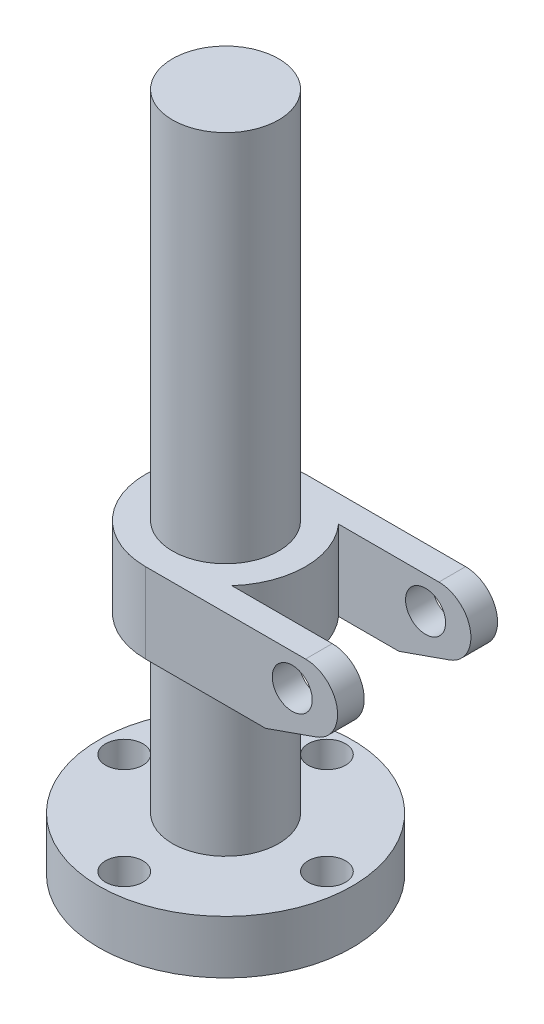
ISO-10303-21;
HEADER;
FILE_DESCRIPTION(('STEP AP214'),'2;1');
FILE_NAME('part.step','',(''),(''),'','','');
FILE_SCHEMA(('AUTOMOTIVE_DESIGN { 1 0 10303 214 1 1 1 1 }'));
ENDSEC;
DATA;
#1=APPLICATION_CONTEXT('core data for automotive mechanical design processes');
#2=APPLICATION_PROTOCOL_DEFINITION('international standard','automotive_design',2000,#1);
#3=PRODUCT_CONTEXT('',#1,'mechanical');
#4=PRODUCT('Part','Part','',(#3));
#5=PRODUCT_RELATED_PRODUCT_CATEGORY('part','',(#4));
#6=PRODUCT_DEFINITION_FORMATION('','',#4);
#7=PRODUCT_DEFINITION_CONTEXT('part definition',#1,'design');
#8=PRODUCT_DEFINITION('design','',#6,#7);
#9=PRODUCT_DEFINITION_SHAPE('','',#8);
#10=(LENGTH_UNIT() NAMED_UNIT(*) SI_UNIT(.MILLI.,.METRE.));
#11=(NAMED_UNIT(*) PLANE_ANGLE_UNIT() SI_UNIT($,.RADIAN.));
#12=(NAMED_UNIT(*) SI_UNIT($,.STERADIAN.) SOLID_ANGLE_UNIT());
#13=UNCERTAINTY_MEASURE_WITH_UNIT(LENGTH_MEASURE(1.E-05),#10,'distance_accuracy_value','');
#14=(GEOMETRIC_REPRESENTATION_CONTEXT(3) GLOBAL_UNCERTAINTY_ASSIGNED_CONTEXT((#13)) GLOBAL_UNIT_ASSIGNED_CONTEXT((#10,
#11,#12)) REPRESENTATION_CONTEXT('',''));
#15=CARTESIAN_POINT('',(0.,0.,0.));
#16=DIRECTION('',(0.,0.,1.));
#17=DIRECTION('',(1.,0.,0.));
#18=AXIS2_PLACEMENT_3D('',#15,#16,#17);
#19=CARTESIAN_POINT('',(0.,115.,0.));
#20=DIRECTION('',(0.,-1.,0.));
#21=DIRECTION('',(0.,0.,-1.));
#22=AXIS2_PLACEMENT_3D('',#19,#20,#21);
#23=PLANE('',#22);
#24=CARTESIAN_POINT('',(0.,115.,0.));
#25=DIRECTION('',(0.,1.,0.));
#26=DIRECTION('',(0.,0.,1.));
#27=AXIS2_PLACEMENT_3D('',#24,#25,#26);
#28=CIRCLE('',#27,19.9);
#29=CARTESIAN_POINT('',(0.,115.,19.9));
#30=VERTEX_POINT('',#29);
#31=EDGE_CURVE('E192',#30,#30,#28,.T.);
#32=ORIENTED_EDGE('',*,*,#31,.F.);
#33=EDGE_LOOP('',(#32));
#34=FACE_BOUND('',#33,.T.);
#35=DIRECTION('',(1.,0.,0.));
#36=VECTOR('',#35,1.);
#37=CARTESIAN_POINT('',(0.,115.,30.));
#38=LINE('',#37,#36);
#39=CARTESIAN_POINT('',(0.,115.,30.));
#40=VERTEX_POINT('',#39);
#41=CARTESIAN_POINT('',(60.,115.,30.));
#42=VERTEX_POINT('',#41);
#43=EDGE_CURVE('E133',#40,#42,#38,.T.);
#44=ORIENTED_EDGE('',*,*,#43,.T.);
#45=DIRECTION('',(0.,0.,-1.));
#46=VECTOR('',#45,1.);
#47=CARTESIAN_POINT('',(60.,115.,47.5));
#48=LINE('',#47,#46);
#49=CARTESIAN_POINT('',(60.,115.,20.));
#50=VERTEX_POINT('',#49);
#51=EDGE_CURVE('E214',#42,#50,#48,.T.);
#52=ORIENTED_EDGE('',*,*,#51,.T.);
#53=DIRECTION('',(1.,0.,0.));
#54=VECTOR('',#53,1.);
#55=CARTESIAN_POINT('',(0.,115.,20.));
#56=LINE('',#55,#54);
#57=CARTESIAN_POINT('',(22.3606797749979,115.,20.));
#58=VERTEX_POINT('',#57);
#59=EDGE_CURVE('E68',#58,#50,#56,.T.);
#60=ORIENTED_EDGE('',*,*,#59,.F.);
#61=CARTESIAN_POINT('',(0.,115.,0.));
#62=DIRECTION('',(0.,1.,0.));
#63=DIRECTION('',(0.,0.,1.));
#64=AXIS2_PLACEMENT_3D('',#61,#62,#63);
#65=CIRCLE('',#64,30.);
#66=CARTESIAN_POINT('',(22.3606797749979,115.,-20.));
#67=VERTEX_POINT('',#66);
#68=EDGE_CURVE('E268',#58,#67,#65,.T.);
#69=ORIENTED_EDGE('',*,*,#68,.T.);
#70=DIRECTION('',(1.,0.,0.));
#71=VECTOR('',#70,1.);
#72=CARTESIAN_POINT('',(0.,115.,-20.));
#73=LINE('',#72,#71);
#74=CARTESIAN_POINT('',(60.,115.,-20.));
#75=VERTEX_POINT('',#74);
#76=EDGE_CURVE('E272',#67,#75,#73,.T.);
#77=ORIENTED_EDGE('',*,*,#76,.T.);
#78=CARTESIAN_POINT('',(60.,115.,-30.));
#79=VERTEX_POINT('',#78);
#80=EDGE_CURVE('E223',#75,#79,#48,.T.);
#81=ORIENTED_EDGE('',*,*,#80,.T.);
#82=DIRECTION('',(-1.,0.,0.));
#83=VECTOR('',#82,1.);
#84=CARTESIAN_POINT('',(0.,115.,-30.));
#85=LINE('',#84,#83);
#86=CARTESIAN_POINT('',(0.,115.,-30.));
#87=VERTEX_POINT('',#86);
#88=EDGE_CURVE('E60',#79,#87,#85,.T.);
#89=ORIENTED_EDGE('',*,*,#88,.T.);
#90=CARTESIAN_POINT('',(0.,115.,0.));
#91=DIRECTION('',(0.,1.,0.));
#92=DIRECTION('',(0.,0.,1.));
#93=AXIS2_PLACEMENT_3D('',#90,#91,#92);
#94=CIRCLE('',#93,30.);
#95=EDGE_CURVE('E188',#87,#40,#94,.T.);
#96=ORIENTED_EDGE('',*,*,#95,.T.);
#97=EDGE_LOOP('',(#44,#52,#60,#69,#77,#81,#89,#96));
#98=FACE_BOUND('',#97,.T.);
#99=ADVANCED_FACE('F44',(#34,#98),#23,.F.);
#100=CARTESIAN_POINT('',(0.,85.,0.));
#101=DIRECTION('',(0.,1.,0.));
#102=DIRECTION('',(0.,0.,1.));
#103=AXIS2_PLACEMENT_3D('',#100,#101,#102);
#104=PLANE('',#103);
#105=CARTESIAN_POINT('',(0.,85.,0.));
#106=DIRECTION('',(0.,1.,0.));
#107=DIRECTION('',(0.,0.,1.));
#108=AXIS2_PLACEMENT_3D('',#105,#106,#107);
#109=CIRCLE('',#108,19.9);
#110=CARTESIAN_POINT('',(0.,85.,19.9));
#111=VERTEX_POINT('',#110);
#112=EDGE_CURVE('E181',#111,#111,#109,.T.);
#113=ORIENTED_EDGE('',*,*,#112,.T.);
#114=EDGE_LOOP('',(#113));
#115=FACE_BOUND('',#114,.T.);
#116=DIRECTION('',(-1.,0.,0.));
#117=VECTOR('',#116,1.);
#118=CARTESIAN_POINT('',(0.,85.,30.));
#119=LINE('',#118,#117);
#120=CARTESIAN_POINT('',(45.,85.,30.));
#121=VERTEX_POINT('',#120);
#122=CARTESIAN_POINT('',(0.,85.,30.));
#123=VERTEX_POINT('',#122);
#124=EDGE_CURVE('E121',#121,#123,#119,.T.);
#125=ORIENTED_EDGE('',*,*,#124,.T.);
#126=CARTESIAN_POINT('',(0.,85.,0.));
#127=DIRECTION('',(0.,1.,0.));
#128=DIRECTION('',(0.,0.,1.));
#129=AXIS2_PLACEMENT_3D('',#126,#127,#128);
#130=CIRCLE('',#129,30.);
#131=CARTESIAN_POINT('',(0.,85.,-30.));
#132=VERTEX_POINT('',#131);
#133=EDGE_CURVE('E185',#132,#123,#130,.T.);
#134=ORIENTED_EDGE('',*,*,#133,.F.);
#135=DIRECTION('',(1.,0.,0.));
#136=VECTOR('',#135,1.);
#137=CARTESIAN_POINT('',(0.,85.,-30.));
#138=LINE('',#137,#136);
#139=CARTESIAN_POINT('',(45.,85.,-30.));
#140=VERTEX_POINT('',#139);
#141=EDGE_CURVE('E233',#132,#140,#138,.T.);
#142=ORIENTED_EDGE('',*,*,#141,.T.);
#143=DIRECTION('',(0.,0.,-1.));
#144=VECTOR('',#143,1.);
#145=CARTESIAN_POINT('',(45.,85.,47.5));
#146=LINE('',#145,#144);
#147=CARTESIAN_POINT('',(45.,85.,-20.));
#148=VERTEX_POINT('',#147);
#149=EDGE_CURVE('E152',#148,#140,#146,.T.);
#150=ORIENTED_EDGE('',*,*,#149,.F.);
#151=DIRECTION('',(-1.,0.,0.));
#152=VECTOR('',#151,1.);
#153=CARTESIAN_POINT('',(0.,85.,-20.));
#154=LINE('',#153,#152);
#155=CARTESIAN_POINT('',(22.3606797749979,85.,-20.));
#156=VERTEX_POINT('',#155);
#157=EDGE_CURVE('E144',#148,#156,#154,.T.);
#158=ORIENTED_EDGE('',*,*,#157,.T.);
#159=CARTESIAN_POINT('',(0.,85.,0.));
#160=DIRECTION('',(0.,1.,0.));
#161=DIRECTION('',(0.,0.,1.));
#162=AXIS2_PLACEMENT_3D('',#159,#160,#161);
#163=CIRCLE('',#162,30.);
#164=CARTESIAN_POINT('',(22.3606797749979,85.,20.));
#165=VERTEX_POINT('',#164);
#166=EDGE_CURVE('E278',#156,#165,#163,.F.);
#167=ORIENTED_EDGE('',*,*,#166,.T.);
#168=DIRECTION('',(-1.,0.,0.));
#169=VECTOR('',#168,1.);
#170=CARTESIAN_POINT('',(0.,85.,20.));
#171=LINE('',#170,#169);
#172=CARTESIAN_POINT('',(45.,85.,20.));
#173=VERTEX_POINT('',#172);
#174=EDGE_CURVE('E150',#173,#165,#171,.T.);
#175=ORIENTED_EDGE('',*,*,#174,.F.);
#176=EDGE_CURVE('E140',#121,#173,#146,.T.);
#177=ORIENTED_EDGE('',*,*,#176,.F.);
#178=EDGE_LOOP('',(#125,#134,#142,#150,#158,#167,#175,#177));
#179=FACE_BOUND('',#178,.T.);
#180=ADVANCED_FACE('F147',(#115,#179),#104,.F.);
#181=CARTESIAN_POINT('',(63.9834538219664,91.6804551483613,47.5));
#182=DIRECTION('',(-0.331954485163873,0.943295404303227,0.));
#183=DIRECTION('',(-0.943295404303227,-0.331954485163873,0.));
#184=AXIS2_PLACEMENT_3D('',#181,#182,#183);
#185=PLANE('',#184);
#186=DIRECTION('',(-0.943295404303227,-0.331954485163873,0.));
#187=VECTOR('',#186,1.);
#188=CARTESIAN_POINT('',(-21.6577399461204,61.5425171743031,30.));
#189=LINE('',#188,#187);
#190=CARTESIAN_POINT('',(63.9834538219665,91.6804551483613,30.));
#191=VERTEX_POINT('',#190);
#192=EDGE_CURVE('E124',#191,#121,#189,.T.);
#193=ORIENTED_EDGE('',*,*,#192,.T.);
#194=ORIENTED_EDGE('',*,*,#176,.T.);
#195=DIRECTION('',(-0.943295404303227,-0.331954485163873,0.));
#196=VECTOR('',#195,1.);
#197=CARTESIAN_POINT('',(-21.6577399461204,61.5425171743031,20.));
#198=LINE('',#197,#196);
#199=CARTESIAN_POINT('',(63.9834538219665,91.6804551483613,20.));
#200=VERTEX_POINT('',#199);
#201=EDGE_CURVE('E281',#200,#173,#198,.T.);
#202=ORIENTED_EDGE('',*,*,#201,.F.);
#203=DIRECTION('',(0.,0.,-1.));
#204=VECTOR('',#203,1.);
#205=CARTESIAN_POINT('',(63.9834538219665,91.6804551483613,47.5));
#206=LINE('',#205,#204);
#207=EDGE_CURVE('E142',#191,#200,#206,.T.);
#208=ORIENTED_EDGE('',*,*,#207,.F.);
#209=EDGE_LOOP('',(#193,#194,#202,#208));
#210=FACE_BOUND('',#209,.T.);
#211=ADVANCED_FACE('F138',(#210),#185,.F.);
#212=DIRECTION('',(-0.943295404303227,-0.331954485163873,0.));
#213=VECTOR('',#212,1.);
#214=CARTESIAN_POINT('',(-21.6577399461204,61.5425171743031,-20.));
#215=LINE('',#214,#213);
#216=CARTESIAN_POINT('',(63.9834538219665,91.6804551483613,-20.));
#217=VERTEX_POINT('',#216);
#218=EDGE_CURVE('E252',#217,#148,#215,.T.);
#219=ORIENTED_EDGE('',*,*,#218,.T.);
#220=ORIENTED_EDGE('',*,*,#149,.T.);
#221=DIRECTION('',(0.943295404303227,0.331954485163873,0.));
#222=VECTOR('',#221,1.);
#223=CARTESIAN_POINT('',(-21.6577399461204,61.5425171743031,-30.));
#224=LINE('',#223,#222);
#225=CARTESIAN_POINT('',(63.9834538219665,91.6804551483613,-30.));
#226=VERTEX_POINT('',#225);
#227=EDGE_CURVE('E237',#140,#226,#224,.T.);
#228=ORIENTED_EDGE('',*,*,#227,.T.);
#229=EDGE_CURVE('E160',#217,#226,#206,.T.);
#230=ORIENTED_EDGE('',*,*,#229,.F.);
#231=EDGE_LOOP('',(#219,#220,#228,#230));
#232=FACE_BOUND('',#231,.T.);
#233=ADVANCED_FACE('F685',(#232),#185,.F.);
#234=CARTESIAN_POINT('',(60.,103.,47.5));
#235=DIRECTION('',(0.,0.,-1.));
#236=DIRECTION('',(-1.,0.,0.));
#237=AXIS2_PLACEMENT_3D('',#234,#235,#236);
#238=CYLINDRICAL_SURFACE('',#237,12.);
#239=CARTESIAN_POINT('',(60.,103.,30.));
#240=DIRECTION('',(0.,0.,1.));
#241=DIRECTION('',(1.,0.,0.));
#242=AXIS2_PLACEMENT_3D('',#239,#240,#241);
#243=CIRCLE('',#242,12.);
#244=EDGE_CURVE('E217',#42,#191,#243,.F.);
#245=ORIENTED_EDGE('',*,*,#244,.T.);
#246=ORIENTED_EDGE('',*,*,#207,.T.);
#247=CARTESIAN_POINT('',(60.,103.,20.));
#248=DIRECTION('',(0.,0.,1.));
#249=DIRECTION('',(1.,0.,0.));
#250=AXIS2_PLACEMENT_3D('',#247,#248,#249);
#251=CIRCLE('',#250,12.);
#252=EDGE_CURVE('E221',#50,#200,#251,.F.);
#253=ORIENTED_EDGE('',*,*,#252,.F.);
#254=ORIENTED_EDGE('',*,*,#51,.F.);
#255=EDGE_LOOP('',(#245,#246,#253,#254));
#256=FACE_BOUND('',#255,.T.);
#257=ADVANCED_FACE('F220',(#256),#238,.T.);
#258=CARTESIAN_POINT('',(60.,103.,-20.));
#259=DIRECTION('',(0.,0.,1.));
#260=DIRECTION('',(1.,0.,0.));
#261=AXIS2_PLACEMENT_3D('',#258,#259,#260);
#262=CIRCLE('',#261,12.);
#263=EDGE_CURVE('E245',#75,#217,#262,.F.);
#264=ORIENTED_EDGE('',*,*,#263,.T.);
#265=ORIENTED_EDGE('',*,*,#229,.T.);
#266=CARTESIAN_POINT('',(60.,103.,-30.));
#267=DIRECTION('',(0.,0.,-1.));
#268=DIRECTION('',(-1.,0.,0.));
#269=AXIS2_PLACEMENT_3D('',#266,#267,#268);
#270=CIRCLE('',#269,12.);
#271=EDGE_CURVE('E241',#226,#79,#270,.F.);
#272=ORIENTED_EDGE('',*,*,#271,.T.);
#273=ORIENTED_EDGE('',*,*,#80,.F.);
#274=EDGE_LOOP('',(#264,#265,#272,#273));
#275=FACE_BOUND('',#274,.T.);
#276=ADVANCED_FACE('F401',(#275),#238,.T.);
#277=CARTESIAN_POINT('',(0.,255.,0.));
#278=DIRECTION('',(0.,1.,0.));
#279=DIRECTION('',(0.,0.,1.));
#280=AXIS2_PLACEMENT_3D('',#277,#278,#279);
#281=CYLINDRICAL_SURFACE('',#280,30.);
#282=DIRECTION('',(0.,1.,0.));
#283=VECTOR('',#282,1.);
#284=CARTESIAN_POINT('',(0.,255.,-30.));
#285=LINE('',#284,#283);
#286=EDGE_CURVE('E156',#132,#87,#285,.T.);
#287=ORIENTED_EDGE('',*,*,#286,.F.);
#288=ORIENTED_EDGE('',*,*,#133,.T.);
#289=DIRECTION('',(0.,1.,0.));
#290=VECTOR('',#289,1.);
#291=CARTESIAN_POINT('',(0.,255.,30.));
#292=LINE('',#291,#290);
#293=EDGE_CURVE('E127',#40,#123,#292,.F.);
#294=ORIENTED_EDGE('',*,*,#293,.F.);
#295=ORIENTED_EDGE('',*,*,#95,.F.);
#296=EDGE_LOOP('',(#287,#288,#294,#295));
#297=FACE_BOUND('',#296,.T.);
#298=ADVANCED_FACE('F394',(#297),#281,.T.);
#299=CARTESIAN_POINT('',(0.,255.,0.));
#300=DIRECTION('',(0.,1.,0.));
#301=DIRECTION('',(0.,0.,1.));
#302=AXIS2_PLACEMENT_3D('',#299,#300,#301);
#303=CYLINDRICAL_SURFACE('',#302,20.);
#304=CARTESIAN_POINT('',(0.,15.,0.));
#305=DIRECTION('',(0.,1.,0.));
#306=DIRECTION('',(0.,0.,1.));
#307=AXIS2_PLACEMENT_3D('',#304,#305,#306);
#308=CIRCLE('',#307,20.);
#309=CARTESIAN_POINT('',(0.,15.,20.));
#310=VERTEX_POINT('',#309);
#311=EDGE_CURVE('E11',#310,#310,#308,.T.);
#312=ORIENTED_EDGE('',*,*,#311,.T.);
#313=EDGE_LOOP('',(#312));
#314=FACE_BOUND('',#313,.T.);
#315=CARTESIAN_POINT('',(0.,0.,0.));
#316=DIRECTION('',(0.,1.,0.));
#317=DIRECTION('',(0.,0.,1.));
#318=AXIS2_PLACEMENT_3D('',#315,#316,#317);
#319=CIRCLE('',#318,20.);
#320=CARTESIAN_POINT('',(0.,0.,20.));
#321=VERTEX_POINT('',#320);
#322=EDGE_CURVE('E165',#321,#321,#319,.T.);
#323=ORIENTED_EDGE('',*,*,#322,.F.);
#324=EDGE_LOOP('',(#323));
#325=FACE_BOUND('',#324,.T.);
#326=ADVANCED_FACE('F46',(#314,#325),#303,.F.);
#327=CARTESIAN_POINT('',(0.,15.,0.));
#328=DIRECTION('',(0.,-1.,0.));
#329=DIRECTION('',(0.,0.,-1.));
#330=AXIS2_PLACEMENT_3D('',#327,#328,#329);
#331=PLANE('',#330);
#332=ORIENTED_EDGE('',*,*,#311,.F.);
#333=EDGE_LOOP('',(#332));
#334=FACE_BOUND('',#333,.T.);
#335=ADVANCED_FACE('F393',(#334),#331,.T.);
#336=CARTESIAN_POINT('',(0.,255.,0.));
#337=DIRECTION('',(0.,-1.,0.));
#338=DIRECTION('',(0.,0.,-1.));
#339=AXIS2_PLACEMENT_3D('',#336,#337,#338);
#340=PLANE('',#339);
#341=CARTESIAN_POINT('',(0.,255.,0.));
#342=DIRECTION('',(0.,1.,0.));
#343=DIRECTION('',(0.,0.,1.));
#344=AXIS2_PLACEMENT_3D('',#341,#342,#343);
#345=CIRCLE('',#344,19.9);
#346=CARTESIAN_POINT('',(0.,255.,19.9));
#347=VERTEX_POINT('',#346);
#348=EDGE_CURVE('E53',#347,#347,#345,.T.);
#349=ORIENTED_EDGE('',*,*,#348,.T.);
#350=EDGE_LOOP('',(#349));
#351=FACE_BOUND('',#350,.T.);
#352=ADVANCED_FACE('F199',(#351),#340,.F.);
#353=CARTESIAN_POINT('',(0.,255.,0.));
#354=DIRECTION('',(0.,1.,0.));
#355=DIRECTION('',(0.,0.,1.));
#356=AXIS2_PLACEMENT_3D('',#353,#354,#355);
#357=CYLINDRICAL_SURFACE('',#356,19.9);
#358=ORIENTED_EDGE('',*,*,#348,.F.);
#359=EDGE_LOOP('',(#358));
#360=FACE_BOUND('',#359,.T.);
#361=ORIENTED_EDGE('',*,*,#31,.T.);
#362=EDGE_LOOP('',(#361));
#363=FACE_BOUND('',#362,.T.);
#364=ADVANCED_FACE('F201',(#360,#363),#357,.T.);
#365=CARTESIAN_POINT('',(0.,255.,0.));
#366=DIRECTION('',(0.,1.,0.));
#367=DIRECTION('',(0.,0.,1.));
#368=AXIS2_PLACEMENT_3D('',#365,#366,#367);
#369=CYLINDRICAL_SURFACE('',#368,19.9);
#370=ORIENTED_EDGE('',*,*,#112,.F.);
#371=EDGE_LOOP('',(#370));
#372=FACE_BOUND('',#371,.T.);
#373=CARTESIAN_POINT('',(0.,20.,0.));
#374=DIRECTION('',(0.,1.,0.));
#375=DIRECTION('',(0.,0.,1.));
#376=AXIS2_PLACEMENT_3D('',#373,#374,#375);
#377=CIRCLE('',#376,19.9);
#378=CARTESIAN_POINT('',(0.,20.,19.9));
#379=VERTEX_POINT('',#378);
#380=EDGE_CURVE('E177',#379,#379,#377,.T.);
#381=ORIENTED_EDGE('',*,*,#380,.T.);
#382=EDGE_LOOP('',(#381));
#383=FACE_BOUND('',#382,.T.);
#384=ADVANCED_FACE('F204',(#372,#383),#369,.T.);
#385=CARTESIAN_POINT('',(0.,20.,0.));
#386=DIRECTION('',(0.,-1.,0.));
#387=DIRECTION('',(0.,0.,-1.));
#388=AXIS2_PLACEMENT_3D('',#385,#386,#387);
#389=PLANE('',#388);
#390=CARTESIAN_POINT('',(0.,20.,-38.));
#391=DIRECTION('',(0.,1.,0.));
#392=DIRECTION('',(0.,0.,1.));
#393=AXIS2_PLACEMENT_3D('',#390,#391,#392);
#394=CIRCLE('',#393,7.);
#395=CARTESIAN_POINT('',(0.,20.,-31.));
#396=VERTEX_POINT('',#395);
#397=EDGE_CURVE('E357',#396,#396,#394,.T.);
#398=ORIENTED_EDGE('',*,*,#397,.F.);
#399=EDGE_LOOP('',(#398));
#400=FACE_BOUND('',#399,.T.);
#401=CARTESIAN_POINT('',(-38.,20.,0.));
#402=DIRECTION('',(0.,1.,0.));
#403=DIRECTION('',(0.,0.,1.));
#404=AXIS2_PLACEMENT_3D('',#401,#402,#403);
#405=CIRCLE('',#404,7.);
#406=CARTESIAN_POINT('',(-38.,20.,7.));
#407=VERTEX_POINT('',#406);
#408=EDGE_CURVE('E341',#407,#407,#405,.T.);
#409=ORIENTED_EDGE('',*,*,#408,.F.);
#410=EDGE_LOOP('',(#409));
#411=FACE_BOUND('',#410,.T.);
#412=CARTESIAN_POINT('',(0.,20.,38.));
#413=DIRECTION('',(0.,1.,0.));
#414=DIRECTION('',(0.,0.,1.));
#415=AXIS2_PLACEMENT_3D('',#412,#413,#414);
#416=CIRCLE('',#415,7.);
#417=CARTESIAN_POINT('',(0.,20.,45.));
#418=VERTEX_POINT('',#417);
#419=EDGE_CURVE('E325',#418,#418,#416,.T.);
#420=ORIENTED_EDGE('',*,*,#419,.F.);
#421=EDGE_LOOP('',(#420));
#422=FACE_BOUND('',#421,.T.);
#423=CARTESIAN_POINT('',(38.,20.,0.));
#424=DIRECTION('',(0.,1.,0.));
#425=DIRECTION('',(0.,0.,1.));
#426=AXIS2_PLACEMENT_3D('',#423,#424,#425);
#427=CIRCLE('',#426,7.);
#428=CARTESIAN_POINT('',(38.,20.,7.));
#429=VERTEX_POINT('',#428);
#430=EDGE_CURVE('E309',#429,#429,#427,.T.);
#431=ORIENTED_EDGE('',*,*,#430,.F.);
#432=EDGE_LOOP('',(#431));
#433=FACE_BOUND('',#432,.T.);
#434=ORIENTED_EDGE('',*,*,#380,.F.);
#435=EDGE_LOOP('',(#434));
#436=FACE_BOUND('',#435,.T.);
#437=CARTESIAN_POINT('',(0.,20.,0.));
#438=DIRECTION('',(0.,1.,0.));
#439=DIRECTION('',(0.,0.,1.));
#440=AXIS2_PLACEMENT_3D('',#437,#438,#439);
#441=CIRCLE('',#440,47.5);
#442=CARTESIAN_POINT('',(0.,20.,47.5));
#443=VERTEX_POINT('',#442);
#444=EDGE_CURVE('E173',#443,#443,#441,.T.);
#445=ORIENTED_EDGE('',*,*,#444,.T.);
#446=EDGE_LOOP('',(#445));
#447=FACE_BOUND('',#446,.T.);
#448=ADVANCED_FACE('F364',(#400,#411,#422,#433,#436,#447),#389,.F.);
#449=CARTESIAN_POINT('',(0.,255.,0.));
#450=DIRECTION('',(0.,1.,0.));
#451=DIRECTION('',(0.,0.,1.));
#452=AXIS2_PLACEMENT_3D('',#449,#450,#451);
#453=CYLINDRICAL_SURFACE('',#452,47.5);
#454=ORIENTED_EDGE('',*,*,#444,.F.);
#455=EDGE_LOOP('',(#454));
#456=FACE_BOUND('',#455,.T.);
#457=CARTESIAN_POINT('',(0.,0.,0.));
#458=DIRECTION('',(0.,1.,0.));
#459=DIRECTION('',(0.,0.,1.));
#460=AXIS2_PLACEMENT_3D('',#457,#458,#459);
#461=CIRCLE('',#460,47.5);
#462=CARTESIAN_POINT('',(0.,0.,47.5));
#463=VERTEX_POINT('',#462);
#464=EDGE_CURVE('E169',#463,#463,#461,.T.);
#465=ORIENTED_EDGE('',*,*,#464,.T.);
#466=EDGE_LOOP('',(#465));
#467=FACE_BOUND('',#466,.T.);
#468=ADVANCED_FACE('F367',(#456,#467),#453,.T.);
#469=CARTESIAN_POINT('',(0.,0.,0.));
#470=DIRECTION('',(0.,1.,0.));
#471=DIRECTION('',(0.,0.,1.));
#472=AXIS2_PLACEMENT_3D('',#469,#470,#471);
#473=PLANE('',#472);
#474=CARTESIAN_POINT('',(0.,0.,-38.));
#475=DIRECTION('',(0.,1.,0.));
#476=DIRECTION('',(0.,0.,1.));
#477=AXIS2_PLACEMENT_3D('',#474,#475,#476);
#478=CIRCLE('',#477,5.);
#479=CARTESIAN_POINT('',(0.,0.,-33.));
#480=VERTEX_POINT('',#479);
#481=EDGE_CURVE('E345',#480,#480,#478,.T.);
#482=ORIENTED_EDGE('',*,*,#481,.T.);
#483=EDGE_LOOP('',(#482));
#484=FACE_BOUND('',#483,.T.);
#485=CARTESIAN_POINT('',(-38.,0.,0.));
#486=DIRECTION('',(0.,1.,0.));
#487=DIRECTION('',(0.,0.,1.));
#488=AXIS2_PLACEMENT_3D('',#485,#486,#487);
#489=CIRCLE('',#488,5.);
#490=CARTESIAN_POINT('',(-38.,0.,5.));
#491=VERTEX_POINT('',#490);
#492=EDGE_CURVE('E329',#491,#491,#489,.T.);
#493=ORIENTED_EDGE('',*,*,#492,.T.);
#494=EDGE_LOOP('',(#493));
#495=FACE_BOUND('',#494,.T.);
#496=CARTESIAN_POINT('',(0.,0.,38.));
#497=DIRECTION('',(0.,1.,0.));
#498=DIRECTION('',(0.,0.,1.));
#499=AXIS2_PLACEMENT_3D('',#496,#497,#498);
#500=CIRCLE('',#499,5.);
#501=CARTESIAN_POINT('',(0.,0.,43.));
#502=VERTEX_POINT('',#501);
#503=EDGE_CURVE('E313',#502,#502,#500,.T.);
#504=ORIENTED_EDGE('',*,*,#503,.T.);
#505=EDGE_LOOP('',(#504));
#506=FACE_BOUND('',#505,.T.);
#507=CARTESIAN_POINT('',(38.,0.,0.));
#508=DIRECTION('',(0.,1.,0.));
#509=DIRECTION('',(0.,0.,1.));
#510=AXIS2_PLACEMENT_3D('',#507,#508,#509);
#511=CIRCLE('',#510,5.);
#512=CARTESIAN_POINT('',(38.,0.,5.));
#513=VERTEX_POINT('',#512);
#514=EDGE_CURVE('E248',#513,#513,#511,.T.);
#515=ORIENTED_EDGE('',*,*,#514,.T.);
#516=EDGE_LOOP('',(#515));
#517=FACE_BOUND('',#516,.T.);
#518=ORIENTED_EDGE('',*,*,#464,.F.);
#519=EDGE_LOOP('',(#518));
#520=FACE_BOUND('',#519,.T.);
#521=ORIENTED_EDGE('',*,*,#322,.T.);
#522=EDGE_LOOP('',(#521));
#523=FACE_BOUND('',#522,.T.);
#524=ADVANCED_FACE('F381',(#484,#495,#506,#517,#520,#523),#473,.F.);
#525=CARTESIAN_POINT('',(0.,-0.001000000000001,-30.));
#526=DIRECTION('',(0.,0.,-1.));
#527=DIRECTION('',(-1.,0.,0.));
#528=AXIS2_PLACEMENT_3D('',#525,#526,#527);
#529=PLANE('',#528);
#530=CARTESIAN_POINT('',(55.,103.,-30.));
#531=DIRECTION('',(0.,0.,-1.));
#532=DIRECTION('',(-1.,0.,0.));
#533=AXIS2_PLACEMENT_3D('',#530,#531,#532);
#534=CIRCLE('',#533,7.5);
#535=CARTESIAN_POINT('',(47.5,103.,-30.));
#536=VERTEX_POINT('',#535);
#537=EDGE_CURVE('E232',#536,#536,#534,.F.);
#538=ORIENTED_EDGE('',*,*,#537,.T.);
#539=EDGE_LOOP('',(#538));
#540=FACE_BOUND('',#539,.T.);
#541=ORIENTED_EDGE('',*,*,#286,.T.);
#542=ORIENTED_EDGE('',*,*,#88,.F.);
#543=ORIENTED_EDGE('',*,*,#271,.F.);
#544=ORIENTED_EDGE('',*,*,#227,.F.);
#545=ORIENTED_EDGE('',*,*,#141,.F.);
#546=EDGE_LOOP('',(#541,#542,#543,#544,#545));
#547=FACE_BOUND('',#546,.T.);
#548=ADVANCED_FACE('F387',(#540,#547),#529,.T.);
#549=CARTESIAN_POINT('',(0.,-0.001000000000001,-20.));
#550=DIRECTION('',(0.,0.,1.));
#551=DIRECTION('',(1.,0.,0.));
#552=AXIS2_PLACEMENT_3D('',#549,#550,#551);
#553=PLANE('',#552);
#554=CARTESIAN_POINT('',(55.,103.,-20.));
#555=DIRECTION('',(0.,0.,1.));
#556=DIRECTION('',(1.,0.,0.));
#557=AXIS2_PLACEMENT_3D('',#554,#555,#556);
#558=CIRCLE('',#557,7.5);
#559=CARTESIAN_POINT('',(62.5,103.,-20.));
#560=VERTEX_POINT('',#559);
#561=EDGE_CURVE('E256',#560,#560,#558,.F.);
#562=ORIENTED_EDGE('',*,*,#561,.T.);
#563=EDGE_LOOP('',(#562));
#564=FACE_BOUND('',#563,.T.);
#565=ORIENTED_EDGE('',*,*,#218,.F.);
#566=ORIENTED_EDGE('',*,*,#263,.F.);
#567=ORIENTED_EDGE('',*,*,#76,.F.);
#568=DIRECTION('',(0.,1.,0.));
#569=VECTOR('',#568,1.);
#570=CARTESIAN_POINT('',(22.3606797749979,-0.001000000000001,-20.));
#571=LINE('',#570,#569);
#572=EDGE_CURVE('E261',#156,#67,#571,.T.);
#573=ORIENTED_EDGE('',*,*,#572,.F.);
#574=ORIENTED_EDGE('',*,*,#157,.F.);
#575=EDGE_LOOP('',(#565,#566,#567,#573,#574));
#576=FACE_BOUND('',#575,.T.);
#577=ADVANCED_FACE('F450',(#564,#576),#553,.T.);
#578=CARTESIAN_POINT('',(0.,-0.001000000000001,0.));
#579=DIRECTION('',(0.,1.,0.));
#580=DIRECTION('',(0.,0.,1.));
#581=AXIS2_PLACEMENT_3D('',#578,#579,#580);
#582=CYLINDRICAL_SURFACE('',#581,30.);
#583=ORIENTED_EDGE('',*,*,#572,.T.);
#584=ORIENTED_EDGE('',*,*,#68,.F.);
#585=DIRECTION('',(0.,1.,0.));
#586=VECTOR('',#585,1.);
#587=CARTESIAN_POINT('',(22.3606797749979,-0.001000000000001,20.));
#588=LINE('',#587,#586);
#589=EDGE_CURVE('E260',#165,#58,#588,.T.);
#590=ORIENTED_EDGE('',*,*,#589,.F.);
#591=ORIENTED_EDGE('',*,*,#166,.F.);
#592=EDGE_LOOP('',(#583,#584,#590,#591));
#593=FACE_BOUND('',#592,.T.);
#594=ADVANCED_FACE('F458',(#593),#582,.T.);
#595=CARTESIAN_POINT('',(0.,-0.001000000000001,20.));
#596=DIRECTION('',(0.,0.,1.));
#597=DIRECTION('',(1.,0.,0.));
#598=AXIS2_PLACEMENT_3D('',#595,#596,#597);
#599=PLANE('',#598);
#600=CARTESIAN_POINT('',(55.,103.,20.));
#601=DIRECTION('',(0.,0.,1.));
#602=DIRECTION('',(1.,0.,0.));
#603=AXIS2_PLACEMENT_3D('',#600,#601,#602);
#604=CIRCLE('',#603,7.5);
#605=CARTESIAN_POINT('',(62.5,103.,20.));
#606=VERTEX_POINT('',#605);
#607=EDGE_CURVE('E284',#606,#606,#604,.F.);
#608=ORIENTED_EDGE('',*,*,#607,.F.);
#609=EDGE_LOOP('',(#608));
#610=FACE_BOUND('',#609,.T.);
#611=ORIENTED_EDGE('',*,*,#174,.T.);
#612=ORIENTED_EDGE('',*,*,#589,.T.);
#613=ORIENTED_EDGE('',*,*,#59,.T.);
#614=ORIENTED_EDGE('',*,*,#252,.T.);
#615=ORIENTED_EDGE('',*,*,#201,.T.);
#616=EDGE_LOOP('',(#611,#612,#613,#614,#615));
#617=FACE_BOUND('',#616,.T.);
#618=ADVANCED_FACE('F466',(#610,#617),#599,.F.);
#619=CARTESIAN_POINT('',(0.,-0.001000000000001,30.));
#620=DIRECTION('',(0.,0.,1.));
#621=DIRECTION('',(1.,0.,0.));
#622=AXIS2_PLACEMENT_3D('',#619,#620,#621);
#623=PLANE('',#622);
#624=CARTESIAN_POINT('',(55.,103.,30.));
#625=DIRECTION('',(0.,0.,1.));
#626=DIRECTION('',(1.,0.,0.));
#627=AXIS2_PLACEMENT_3D('',#624,#625,#626);
#628=CIRCLE('',#627,7.5);
#629=CARTESIAN_POINT('',(62.5,103.,30.));
#630=VERTEX_POINT('',#629);
#631=EDGE_CURVE('E228',#630,#630,#628,.F.);
#632=ORIENTED_EDGE('',*,*,#631,.T.);
#633=EDGE_LOOP('',(#632));
#634=FACE_BOUND('',#633,.T.);
#635=ORIENTED_EDGE('',*,*,#192,.F.);
#636=ORIENTED_EDGE('',*,*,#244,.F.);
#637=ORIENTED_EDGE('',*,*,#43,.F.);
#638=ORIENTED_EDGE('',*,*,#293,.T.);
#639=ORIENTED_EDGE('',*,*,#124,.F.);
#640=EDGE_LOOP('',(#635,#636,#637,#638,#639));
#641=FACE_BOUND('',#640,.T.);
#642=ADVANCED_FACE('F123',(#634,#641),#623,.T.);
#643=CARTESIAN_POINT('',(55.,103.,47.5));
#644=DIRECTION('',(0.,0.,-1.));
#645=DIRECTION('',(-1.,0.,0.));
#646=AXIS2_PLACEMENT_3D('',#643,#644,#645);
#647=CYLINDRICAL_SURFACE('',#646,7.5);
#648=ORIENTED_EDGE('',*,*,#537,.F.);
#649=EDGE_LOOP('',(#648));
#650=FACE_BOUND('',#649,.T.);
#651=ORIENTED_EDGE('',*,*,#561,.F.);
#652=EDGE_LOOP('',(#651));
#653=FACE_BOUND('',#652,.T.);
#654=ADVANCED_FACE('F481',(#650,#653),#647,.F.);
#655=ORIENTED_EDGE('',*,*,#607,.T.);
#656=EDGE_LOOP('',(#655));
#657=FACE_BOUND('',#656,.T.);
#658=ORIENTED_EDGE('',*,*,#631,.F.);
#659=EDGE_LOOP('',(#658));
#660=FACE_BOUND('',#659,.T.);
#661=ADVANCED_FACE('F489',(#657,#660),#647,.F.);
#662=CARTESIAN_POINT('',(38.,20.,0.));
#663=DIRECTION('',(0.,1.,0.));
#664=DIRECTION('',(0.,0.,1.));
#665=AXIS2_PLACEMENT_3D('',#662,#663,#664);
#666=CYLINDRICAL_SURFACE('',#665,5.);
#667=ORIENTED_EDGE('',*,*,#514,.F.);
#668=EDGE_LOOP('',(#667));
#669=FACE_BOUND('',#668,.T.);
#670=CARTESIAN_POINT('',(38.,9.99999999999999,0.));
#671=DIRECTION('',(0.,1.,0.));
#672=DIRECTION('',(0.,0.,1.));
#673=AXIS2_PLACEMENT_3D('',#670,#671,#672);
#674=CIRCLE('',#673,5.);
#675=CARTESIAN_POINT('',(38.,9.99999999999999,5.));
#676=VERTEX_POINT('',#675);
#677=EDGE_CURVE('E301',#676,#676,#674,.T.);
#678=ORIENTED_EDGE('',*,*,#677,.T.);
#679=EDGE_LOOP('',(#678));
#680=FACE_BOUND('',#679,.T.);
#681=ADVANCED_FACE('F496',(#669,#680),#666,.F.);
#682=CARTESIAN_POINT('',(43.,9.99999999999999,0.));
#683=DIRECTION('',(0.,-1.,0.));
#684=DIRECTION('',(0.,0.,-1.));
#685=AXIS2_PLACEMENT_3D('',#682,#683,#684);
#686=PLANE('',#685);
#687=ORIENTED_EDGE('',*,*,#677,.F.);
#688=EDGE_LOOP('',(#687));
#689=FACE_BOUND('',#688,.T.);
#690=CARTESIAN_POINT('',(38.,9.99999999999999,0.));
#691=DIRECTION('',(0.,1.,0.));
#692=DIRECTION('',(0.,0.,1.));
#693=AXIS2_PLACEMENT_3D('',#690,#691,#692);
#694=CIRCLE('',#693,7.);
#695=CARTESIAN_POINT('',(38.,9.99999999999999,7.));
#696=VERTEX_POINT('',#695);
#697=EDGE_CURVE('E305',#696,#696,#694,.T.);
#698=ORIENTED_EDGE('',*,*,#697,.T.);
#699=EDGE_LOOP('',(#698));
#700=FACE_BOUND('',#699,.T.);
#701=ADVANCED_FACE('F502',(#689,#700),#686,.F.);
#702=CARTESIAN_POINT('',(38.,20.,0.));
#703=DIRECTION('',(0.,1.,0.));
#704=DIRECTION('',(0.,0.,1.));
#705=AXIS2_PLACEMENT_3D('',#702,#703,#704);
#706=CYLINDRICAL_SURFACE('',#705,7.);
#707=ORIENTED_EDGE('',*,*,#697,.F.);
#708=EDGE_LOOP('',(#707));
#709=FACE_BOUND('',#708,.T.);
#710=ORIENTED_EDGE('',*,*,#430,.T.);
#711=EDGE_LOOP('',(#710));
#712=FACE_BOUND('',#711,.T.);
#713=ADVANCED_FACE('F510',(#709,#712),#706,.F.);
#714=CARTESIAN_POINT('',(0.,20.,38.));
#715=DIRECTION('',(0.,1.,0.));
#716=DIRECTION('',(0.,0.,1.));
#717=AXIS2_PLACEMENT_3D('',#714,#715,#716);
#718=CYLINDRICAL_SURFACE('',#717,5.);
#719=ORIENTED_EDGE('',*,*,#503,.F.);
#720=EDGE_LOOP('',(#719));
#721=FACE_BOUND('',#720,.T.);
#722=CARTESIAN_POINT('',(0.,9.99999999999999,38.));
#723=DIRECTION('',(0.,1.,0.));
#724=DIRECTION('',(0.,0.,1.));
#725=AXIS2_PLACEMENT_3D('',#722,#723,#724);
#726=CIRCLE('',#725,5.);
#727=CARTESIAN_POINT('',(0.,9.99999999999999,43.));
#728=VERTEX_POINT('',#727);
#729=EDGE_CURVE('E317',#728,#728,#726,.T.);
#730=ORIENTED_EDGE('',*,*,#729,.T.);
#731=EDGE_LOOP('',(#730));
#732=FACE_BOUND('',#731,.T.);
#733=ADVANCED_FACE('F518',(#721,#732),#718,.F.);
#734=CARTESIAN_POINT('',(5.,9.99999999999999,38.));
#735=DIRECTION('',(0.,-1.,0.));
#736=DIRECTION('',(0.,0.,-1.));
#737=AXIS2_PLACEMENT_3D('',#734,#735,#736);
#738=PLANE('',#737);
#739=ORIENTED_EDGE('',*,*,#729,.F.);
#740=EDGE_LOOP('',(#739));
#741=FACE_BOUND('',#740,.T.);
#742=CARTESIAN_POINT('',(0.,9.99999999999999,38.));
#743=DIRECTION('',(0.,1.,0.));
#744=DIRECTION('',(0.,0.,1.));
#745=AXIS2_PLACEMENT_3D('',#742,#743,#744);
#746=CIRCLE('',#745,7.);
#747=CARTESIAN_POINT('',(0.,9.99999999999999,45.));
#748=VERTEX_POINT('',#747);
#749=EDGE_CURVE('E321',#748,#748,#746,.T.);
#750=ORIENTED_EDGE('',*,*,#749,.T.);
#751=EDGE_LOOP('',(#750));
#752=FACE_BOUND('',#751,.T.);
#753=ADVANCED_FACE('F526',(#741,#752),#738,.F.);
#754=CARTESIAN_POINT('',(0.,20.,38.));
#755=DIRECTION('',(0.,1.,0.));
#756=DIRECTION('',(0.,0.,1.));
#757=AXIS2_PLACEMENT_3D('',#754,#755,#756);
#758=CYLINDRICAL_SURFACE('',#757,7.);
#759=ORIENTED_EDGE('',*,*,#749,.F.);
#760=EDGE_LOOP('',(#759));
#761=FACE_BOUND('',#760,.T.);
#762=ORIENTED_EDGE('',*,*,#419,.T.);
#763=EDGE_LOOP('',(#762));
#764=FACE_BOUND('',#763,.T.);
#765=ADVANCED_FACE('F534',(#761,#764),#758,.F.);
#766=CARTESIAN_POINT('',(-38.,20.,0.));
#767=DIRECTION('',(0.,1.,0.));
#768=DIRECTION('',(0.,0.,1.));
#769=AXIS2_PLACEMENT_3D('',#766,#767,#768);
#770=CYLINDRICAL_SURFACE('',#769,5.);
#771=ORIENTED_EDGE('',*,*,#492,.F.);
#772=EDGE_LOOP('',(#771));
#773=FACE_BOUND('',#772,.T.);
#774=CARTESIAN_POINT('',(-38.,9.99999999999999,0.));
#775=DIRECTION('',(0.,1.,0.));
#776=DIRECTION('',(0.,0.,1.));
#777=AXIS2_PLACEMENT_3D('',#774,#775,#776);
#778=CIRCLE('',#777,5.);
#779=CARTESIAN_POINT('',(-38.,9.99999999999999,5.));
#780=VERTEX_POINT('',#779);
#781=EDGE_CURVE('E333',#780,#780,#778,.T.);
#782=ORIENTED_EDGE('',*,*,#781,.T.);
#783=EDGE_LOOP('',(#782));
#784=FACE_BOUND('',#783,.T.);
#785=ADVANCED_FACE('F542',(#773,#784),#770,.F.);
#786=CARTESIAN_POINT('',(-33.,9.99999999999999,0.));
#787=DIRECTION('',(0.,-1.,0.));
#788=DIRECTION('',(0.,0.,-1.));
#789=AXIS2_PLACEMENT_3D('',#786,#787,#788);
#790=PLANE('',#789);
#791=ORIENTED_EDGE('',*,*,#781,.F.);
#792=EDGE_LOOP('',(#791));
#793=FACE_BOUND('',#792,.T.);
#794=CARTESIAN_POINT('',(-38.,9.99999999999999,0.));
#795=DIRECTION('',(0.,1.,0.));
#796=DIRECTION('',(0.,0.,1.));
#797=AXIS2_PLACEMENT_3D('',#794,#795,#796);
#798=CIRCLE('',#797,7.);
#799=CARTESIAN_POINT('',(-38.,9.99999999999999,7.));
#800=VERTEX_POINT('',#799);
#801=EDGE_CURVE('E337',#800,#800,#798,.T.);
#802=ORIENTED_EDGE('',*,*,#801,.T.);
#803=EDGE_LOOP('',(#802));
#804=FACE_BOUND('',#803,.T.);
#805=ADVANCED_FACE('F550',(#793,#804),#790,.F.);
#806=CARTESIAN_POINT('',(-38.,20.,0.));
#807=DIRECTION('',(0.,1.,0.));
#808=DIRECTION('',(0.,0.,1.));
#809=AXIS2_PLACEMENT_3D('',#806,#807,#808);
#810=CYLINDRICAL_SURFACE('',#809,7.);
#811=ORIENTED_EDGE('',*,*,#801,.F.);
#812=EDGE_LOOP('',(#811));
#813=FACE_BOUND('',#812,.T.);
#814=ORIENTED_EDGE('',*,*,#408,.T.);
#815=EDGE_LOOP('',(#814));
#816=FACE_BOUND('',#815,.T.);
#817=ADVANCED_FACE('F558',(#813,#816),#810,.F.);
#818=CARTESIAN_POINT('',(0.,20.,-38.));
#819=DIRECTION('',(0.,1.,0.));
#820=DIRECTION('',(0.,0.,1.));
#821=AXIS2_PLACEMENT_3D('',#818,#819,#820);
#822=CYLINDRICAL_SURFACE('',#821,5.);
#823=ORIENTED_EDGE('',*,*,#481,.F.);
#824=EDGE_LOOP('',(#823));
#825=FACE_BOUND('',#824,.T.);
#826=CARTESIAN_POINT('',(0.,9.99999999999999,-38.));
#827=DIRECTION('',(0.,1.,0.));
#828=DIRECTION('',(0.,0.,1.));
#829=AXIS2_PLACEMENT_3D('',#826,#827,#828);
#830=CIRCLE('',#829,5.);
#831=CARTESIAN_POINT('',(0.,9.99999999999999,-33.));
#832=VERTEX_POINT('',#831);
#833=EDGE_CURVE('E349',#832,#832,#830,.T.);
#834=ORIENTED_EDGE('',*,*,#833,.T.);
#835=EDGE_LOOP('',(#834));
#836=FACE_BOUND('',#835,.T.);
#837=ADVANCED_FACE('F566',(#825,#836),#822,.F.);
#838=CARTESIAN_POINT('',(5.,9.99999999999999,-38.));
#839=DIRECTION('',(0.,-1.,0.));
#840=DIRECTION('',(0.,0.,-1.));
#841=AXIS2_PLACEMENT_3D('',#838,#839,#840);
#842=PLANE('',#841);
#843=ORIENTED_EDGE('',*,*,#833,.F.);
#844=EDGE_LOOP('',(#843));
#845=FACE_BOUND('',#844,.T.);
#846=CARTESIAN_POINT('',(0.,9.99999999999999,-38.));
#847=DIRECTION('',(0.,1.,0.));
#848=DIRECTION('',(0.,0.,1.));
#849=AXIS2_PLACEMENT_3D('',#846,#847,#848);
#850=CIRCLE('',#849,7.);
#851=CARTESIAN_POINT('',(0.,9.99999999999999,-31.));
#852=VERTEX_POINT('',#851);
#853=EDGE_CURVE('E353',#852,#852,#850,.T.);
#854=ORIENTED_EDGE('',*,*,#853,.T.);
#855=EDGE_LOOP('',(#854));
#856=FACE_BOUND('',#855,.T.);
#857=ADVANCED_FACE('F574',(#845,#856),#842,.F.);
#858=CARTESIAN_POINT('',(0.,20.,-38.));
#859=DIRECTION('',(0.,1.,0.));
#860=DIRECTION('',(0.,0.,1.));
#861=AXIS2_PLACEMENT_3D('',#858,#859,#860);
#862=CYLINDRICAL_SURFACE('',#861,7.);
#863=ORIENTED_EDGE('',*,*,#853,.F.);
#864=EDGE_LOOP('',(#863));
#865=FACE_BOUND('',#864,.T.);
#866=ORIENTED_EDGE('',*,*,#397,.T.);
#867=EDGE_LOOP('',(#866));
#868=FACE_BOUND('',#867,.T.);
#869=ADVANCED_FACE('F362',(#865,#868),#862,.F.);
#870=CLOSED_SHELL('',(#99,#180,#211,#233,#257,#276,#298,#326,#335,#352,#364,#384,#448,#468,#524,
#548,#577,#594,#618,#642,#654,#661,#681,#701,#713,#733,#753,#765,#785,#805,#817,#837,#857,#869));
#871=MANIFOLD_SOLID_BREP('B2',#870);
#872=ADVANCED_BREP_SHAPE_REPRESENTATION('',(#18,#871),#14);
#873=SHAPE_DEFINITION_REPRESENTATION(#9,#872);
ENDSEC;
END-ISO-10303-21;
